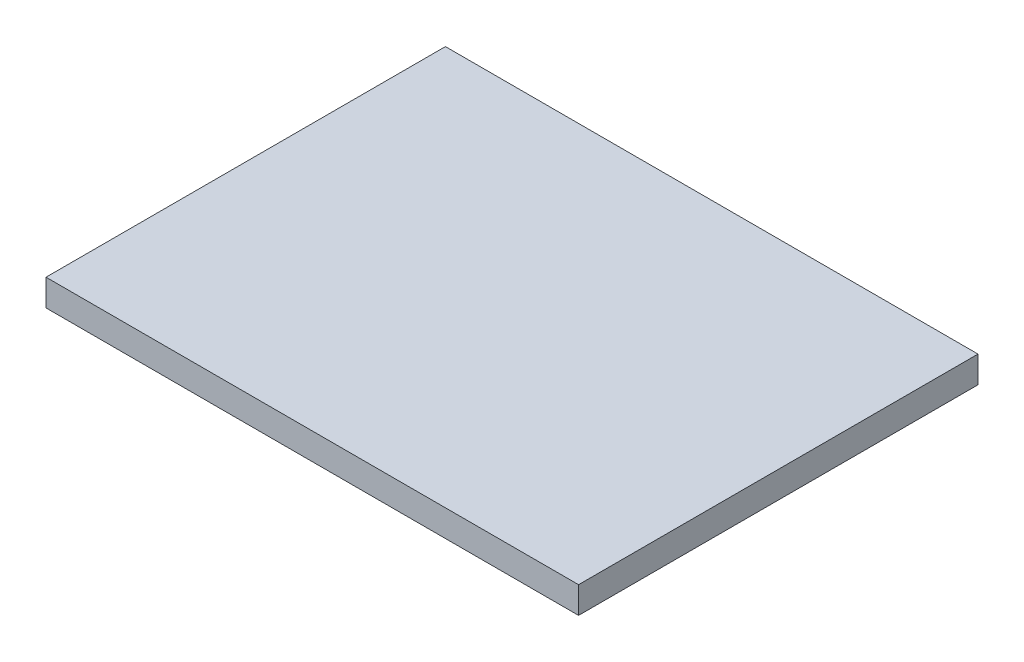
ISO-10303-21;
HEADER;
FILE_DESCRIPTION(('STEP AP214'),'2;1');
FILE_NAME('part.step','',(''),(''),'','','');
FILE_SCHEMA(('AUTOMOTIVE_DESIGN { 1 0 10303 214 1 1 1 1 }'));
ENDSEC;
DATA;
#1=APPLICATION_CONTEXT('core data for automotive mechanical design processes');
#2=APPLICATION_PROTOCOL_DEFINITION('international standard','automotive_design',2000,#1);
#3=PRODUCT_CONTEXT('',#1,'mechanical');
#4=PRODUCT('Part','Part','',(#3));
#5=PRODUCT_RELATED_PRODUCT_CATEGORY('part','',(#4));
#6=PRODUCT_DEFINITION_FORMATION('','',#4);
#7=PRODUCT_DEFINITION_CONTEXT('part definition',#1,'design');
#8=PRODUCT_DEFINITION('design','',#6,#7);
#9=PRODUCT_DEFINITION_SHAPE('','',#8);
#10=(LENGTH_UNIT() NAMED_UNIT(*) SI_UNIT(.MILLI.,.METRE.));
#11=(NAMED_UNIT(*) PLANE_ANGLE_UNIT() SI_UNIT($,.RADIAN.));
#12=(NAMED_UNIT(*) SI_UNIT($,.STERADIAN.) SOLID_ANGLE_UNIT());
#13=UNCERTAINTY_MEASURE_WITH_UNIT(LENGTH_MEASURE(1.E-05),#10,'distance_accuracy_value','');
#14=(GEOMETRIC_REPRESENTATION_CONTEXT(3) GLOBAL_UNCERTAINTY_ASSIGNED_CONTEXT((#13)) GLOBAL_UNIT_ASSIGNED_CONTEXT((#10,
#11,#12)) REPRESENTATION_CONTEXT('',''));
#15=CARTESIAN_POINT('',(0.,0.,0.));
#16=DIRECTION('',(0.,0.,1.));
#17=DIRECTION('',(1.,0.,0.));
#18=AXIS2_PLACEMENT_3D('',#15,#16,#17);
#19=CARTESIAN_POINT('',(-100.,10.,75.));
#20=DIRECTION('',(1.,0.,0.));
#21=DIRECTION('',(0.,0.,-1.));
#22=AXIS2_PLACEMENT_3D('',#19,#20,#21);
#23=PLANE('',#22);
#24=DIRECTION('',(0.,0.,1.));
#25=VECTOR('',#24,1.);
#26=CARTESIAN_POINT('',(-100.,0.,75.));
#27=LINE('',#26,#25);
#28=CARTESIAN_POINT('',(-100.,0.,-75.));
#29=VERTEX_POINT('',#28);
#30=CARTESIAN_POINT('',(-100.,0.,75.));
#31=VERTEX_POINT('',#30);
#32=EDGE_CURVE('E96',#29,#31,#27,.T.);
#33=ORIENTED_EDGE('',*,*,#32,.T.);
#34=DIRECTION('',(0.,-1.,0.));
#35=VECTOR('',#34,1.);
#36=CARTESIAN_POINT('',(-100.,10.,75.));
#37=LINE('',#36,#35);
#38=CARTESIAN_POINT('',(-100.,10.,75.));
#39=VERTEX_POINT('',#38);
#40=EDGE_CURVE('E11',#39,#31,#37,.T.);
#41=ORIENTED_EDGE('',*,*,#40,.F.);
#42=DIRECTION('',(0.,0.,1.));
#43=VECTOR('',#42,1.);
#44=CARTESIAN_POINT('',(-100.,10.,75.));
#45=LINE('',#44,#43);
#46=CARTESIAN_POINT('',(-100.,10.,-75.));
#47=VERTEX_POINT('',#46);
#48=EDGE_CURVE('E84',#47,#39,#45,.T.);
#49=ORIENTED_EDGE('',*,*,#48,.F.);
#50=DIRECTION('',(0.,-1.,0.));
#51=VECTOR('',#50,1.);
#52=CARTESIAN_POINT('',(-100.,10.,-75.));
#53=LINE('',#52,#51);
#54=EDGE_CURVE('E92',#47,#29,#53,.T.);
#55=ORIENTED_EDGE('',*,*,#54,.T.);
#56=EDGE_LOOP('',(#33,#41,#49,#55));
#57=FACE_BOUND('',#56,.T.);
#58=ADVANCED_FACE('F33',(#57),#23,.F.);
#59=CARTESIAN_POINT('',(100.,10.,75.));
#60=DIRECTION('',(0.,0.,-1.));
#61=DIRECTION('',(-1.,0.,0.));
#62=AXIS2_PLACEMENT_3D('',#59,#60,#61);
#63=PLANE('',#62);
#64=DIRECTION('',(1.,0.,0.));
#65=VECTOR('',#64,1.);
#66=CARTESIAN_POINT('',(100.,0.,75.));
#67=LINE('',#66,#65);
#68=CARTESIAN_POINT('',(100.,0.,75.));
#69=VERTEX_POINT('',#68);
#70=EDGE_CURVE('E88',#31,#69,#67,.T.);
#71=ORIENTED_EDGE('',*,*,#70,.T.);
#72=DIRECTION('',(0.,-1.,0.));
#73=VECTOR('',#72,1.);
#74=CARTESIAN_POINT('',(100.,10.,75.));
#75=LINE('',#74,#73);
#76=CARTESIAN_POINT('',(100.,10.,75.));
#77=VERTEX_POINT('',#76);
#78=EDGE_CURVE('E41',#77,#69,#75,.T.);
#79=ORIENTED_EDGE('',*,*,#78,.F.);
#80=DIRECTION('',(1.,0.,0.));
#81=VECTOR('',#80,1.);
#82=CARTESIAN_POINT('',(100.,10.,75.));
#83=LINE('',#82,#81);
#84=EDGE_CURVE('E79',#39,#77,#83,.T.);
#85=ORIENTED_EDGE('',*,*,#84,.F.);
#86=ORIENTED_EDGE('',*,*,#40,.T.);
#87=EDGE_LOOP('',(#71,#79,#85,#86));
#88=FACE_BOUND('',#87,.T.);
#89=ADVANCED_FACE('F87',(#88),#63,.F.);
#90=CARTESIAN_POINT('',(100.,10.,75.));
#91=DIRECTION('',(-1.,0.,0.));
#92=DIRECTION('',(0.,0.,1.));
#93=AXIS2_PLACEMENT_3D('',#90,#91,#92);
#94=PLANE('',#93);
#95=DIRECTION('',(0.,0.,-1.));
#96=VECTOR('',#95,1.);
#97=CARTESIAN_POINT('',(100.,0.,75.));
#98=LINE('',#97,#96);
#99=CARTESIAN_POINT('',(100.,0.,-75.));
#100=VERTEX_POINT('',#99);
#101=EDGE_CURVE('E66',#69,#100,#98,.T.);
#102=ORIENTED_EDGE('',*,*,#101,.T.);
#103=DIRECTION('',(0.,-1.,0.));
#104=VECTOR('',#103,1.);
#105=CARTESIAN_POINT('',(100.,10.,-75.));
#106=LINE('',#105,#104);
#107=CARTESIAN_POINT('',(100.,10.,-75.));
#108=VERTEX_POINT('',#107);
#109=EDGE_CURVE('E89',#108,#100,#106,.T.);
#110=ORIENTED_EDGE('',*,*,#109,.F.);
#111=DIRECTION('',(0.,0.,-1.));
#112=VECTOR('',#111,1.);
#113=CARTESIAN_POINT('',(100.,10.,75.));
#114=LINE('',#113,#112);
#115=EDGE_CURVE('E82',#77,#108,#114,.T.);
#116=ORIENTED_EDGE('',*,*,#115,.F.);
#117=ORIENTED_EDGE('',*,*,#78,.T.);
#118=EDGE_LOOP('',(#102,#110,#116,#117));
#119=FACE_BOUND('',#118,.T.);
#120=ADVANCED_FACE('F90',(#119),#94,.F.);
#121=CARTESIAN_POINT('',(100.,10.,-75.));
#122=DIRECTION('',(0.,0.,1.));
#123=DIRECTION('',(1.,0.,0.));
#124=AXIS2_PLACEMENT_3D('',#121,#122,#123);
#125=PLANE('',#124);
#126=DIRECTION('',(-1.,0.,0.));
#127=VECTOR('',#126,1.);
#128=CARTESIAN_POINT('',(100.,0.,-75.));
#129=LINE('',#128,#127);
#130=EDGE_CURVE('E72',#100,#29,#129,.T.);
#131=ORIENTED_EDGE('',*,*,#130,.T.);
#132=ORIENTED_EDGE('',*,*,#54,.F.);
#133=DIRECTION('',(-1.,0.,0.));
#134=VECTOR('',#133,1.);
#135=CARTESIAN_POINT('',(100.,10.,-75.));
#136=LINE('',#135,#134);
#137=EDGE_CURVE('E49',#108,#47,#136,.T.);
#138=ORIENTED_EDGE('',*,*,#137,.F.);
#139=ORIENTED_EDGE('',*,*,#109,.T.);
#140=EDGE_LOOP('',(#131,#132,#138,#139));
#141=FACE_BOUND('',#140,.T.);
#142=ADVANCED_FACE('F103',(#141),#125,.F.);
#143=CARTESIAN_POINT('',(0.,10.,0.));
#144=DIRECTION('',(0.,1.,0.));
#145=DIRECTION('',(0.,0.,1.));
#146=AXIS2_PLACEMENT_3D('',#143,#144,#145);
#147=PLANE('',#146);
#148=ORIENTED_EDGE('',*,*,#48,.T.);
#149=ORIENTED_EDGE('',*,*,#84,.T.);
#150=ORIENTED_EDGE('',*,*,#115,.T.);
#151=ORIENTED_EDGE('',*,*,#137,.T.);
#152=EDGE_LOOP('',(#148,#149,#150,#151));
#153=FACE_BOUND('',#152,.T.);
#154=ADVANCED_FACE('F80',(#153),#147,.T.);
#155=CARTESIAN_POINT('',(0.,0.,0.));
#156=DIRECTION('',(0.,1.,0.));
#157=DIRECTION('',(0.,0.,1.));
#158=AXIS2_PLACEMENT_3D('',#155,#156,#157);
#159=PLANE('',#158);
#160=ORIENTED_EDGE('',*,*,#32,.F.);
#161=ORIENTED_EDGE('',*,*,#130,.F.);
#162=ORIENTED_EDGE('',*,*,#101,.F.);
#163=ORIENTED_EDGE('',*,*,#70,.F.);
#164=EDGE_LOOP('',(#160,#161,#162,#163));
#165=FACE_BOUND('',#164,.T.);
#166=ADVANCED_FACE('F106',(#165),#159,.F.);
#167=CLOSED_SHELL('',(#58,#89,#120,#142,#154,#166));
#168=MANIFOLD_SOLID_BREP('B2',#167);
#169=ADVANCED_BREP_SHAPE_REPRESENTATION('',(#18,#168),#14);
#170=SHAPE_DEFINITION_REPRESENTATION(#9,#169);
ENDSEC;
END-ISO-10303-21;
